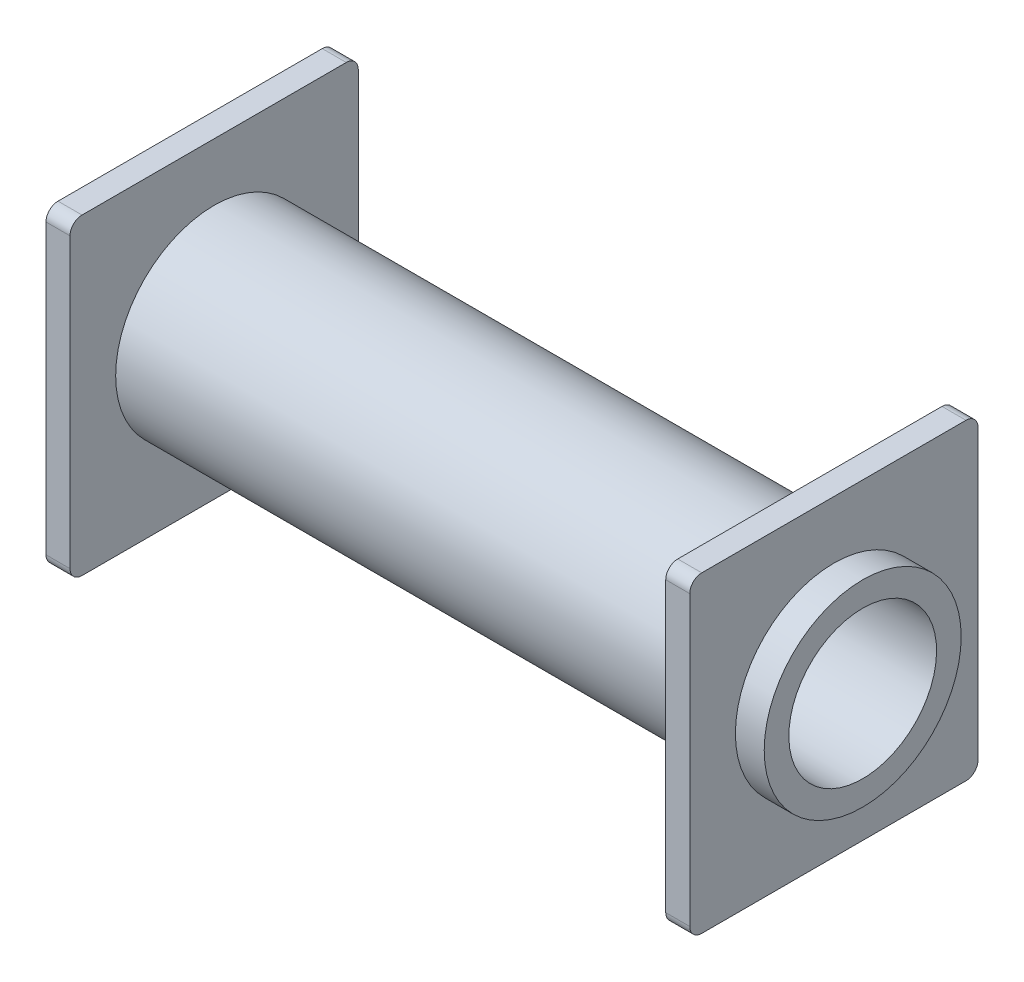
ISO-10303-21;
HEADER;
FILE_DESCRIPTION(('STEP AP214'),'2;1');
FILE_NAME('part.step','',(''),(''),'','','');
FILE_SCHEMA(('AUTOMOTIVE_DESIGN { 1 0 10303 214 1 1 1 1 }'));
ENDSEC;
DATA;
#1=APPLICATION_CONTEXT('core data for automotive mechanical design processes');
#2=APPLICATION_PROTOCOL_DEFINITION('international standard','automotive_design',2000,#1);
#3=PRODUCT_CONTEXT('',#1,'mechanical');
#4=PRODUCT('Part','Part','',(#3));
#5=PRODUCT_RELATED_PRODUCT_CATEGORY('part','',(#4));
#6=PRODUCT_DEFINITION_FORMATION('','',#4);
#7=PRODUCT_DEFINITION_CONTEXT('part definition',#1,'design');
#8=PRODUCT_DEFINITION('design','',#6,#7);
#9=PRODUCT_DEFINITION_SHAPE('','',#8);
#10=(LENGTH_UNIT() NAMED_UNIT(*) SI_UNIT(.MILLI.,.METRE.));
#11=(NAMED_UNIT(*) PLANE_ANGLE_UNIT() SI_UNIT($,.RADIAN.));
#12=(NAMED_UNIT(*) SI_UNIT($,.STERADIAN.) SOLID_ANGLE_UNIT());
#13=UNCERTAINTY_MEASURE_WITH_UNIT(LENGTH_MEASURE(1.E-05),#10,'distance_accuracy_value','');
#14=(GEOMETRIC_REPRESENTATION_CONTEXT(3) GLOBAL_UNCERTAINTY_ASSIGNED_CONTEXT((#13)) GLOBAL_UNIT_ASSIGNED_CONTEXT((#10,
#11,#12)) REPRESENTATION_CONTEXT('',''));
#15=CARTESIAN_POINT('',(0.,0.,0.));
#16=DIRECTION('',(0.,0.,1.));
#17=DIRECTION('',(1.,0.,0.));
#18=AXIS2_PLACEMENT_3D('',#15,#16,#17);
#19=CARTESIAN_POINT('',(-14.,0.,0.));
#20=DIRECTION('',(-1.,0.,0.));
#21=DIRECTION('',(0.,-1.,0.));
#22=AXIS2_PLACEMENT_3D('',#19,#20,#21);
#23=CYLINDRICAL_SURFACE('',#22,4.1);
#24=CARTESIAN_POINT('',(12.8,0.,0.));
#25=DIRECTION('',(1.,0.,0.));
#26=DIRECTION('',(0.,1.,0.));
#27=AXIS2_PLACEMENT_3D('',#24,#25,#26);
#28=CIRCLE('',#27,4.1);
#29=CARTESIAN_POINT('',(12.8,4.1,0.));
#30=VERTEX_POINT('',#29);
#31=EDGE_CURVE('E321',#30,#30,#28,.T.);
#32=ORIENTED_EDGE('',*,*,#31,.T.);
#33=EDGE_LOOP('',(#32));
#34=FACE_BOUND('',#33,.T.);
#35=CARTESIAN_POINT('',(14.,0.,0.));
#36=DIRECTION('',(-1.,0.,0.));
#37=DIRECTION('',(0.,-1.,0.));
#38=AXIS2_PLACEMENT_3D('',#35,#36,#37);
#39=CIRCLE('',#38,4.1);
#40=CARTESIAN_POINT('',(14.,-4.09999999999999,0.));
#41=VERTEX_POINT('',#40);
#42=EDGE_CURVE('E193',#41,#41,#39,.T.);
#43=ORIENTED_EDGE('',*,*,#42,.T.);
#44=EDGE_LOOP('',(#43));
#45=FACE_BOUND('',#44,.T.);
#46=ADVANCED_FACE('F41',(#34,#45),#23,.T.);
#47=CARTESIAN_POINT('',(14.,0.,0.));
#48=DIRECTION('',(-1.,0.,0.));
#49=DIRECTION('',(0.,-1.,0.));
#50=AXIS2_PLACEMENT_3D('',#47,#48,#49);
#51=PLANE('',#50);
#52=CARTESIAN_POINT('',(14.,0.,0.));
#53=DIRECTION('',(1.,0.,0.));
#54=DIRECTION('',(0.,1.,0.));
#55=AXIS2_PLACEMENT_3D('',#52,#53,#54);
#56=CIRCLE('',#55,3.075);
#57=CARTESIAN_POINT('',(14.,3.07500000000001,0.));
#58=VERTEX_POINT('',#57);
#59=EDGE_CURVE('E445',#58,#58,#56,.T.);
#60=ORIENTED_EDGE('',*,*,#59,.F.);
#61=EDGE_LOOP('',(#60));
#62=FACE_BOUND('',#61,.T.);
#63=ORIENTED_EDGE('',*,*,#42,.F.);
#64=EDGE_LOOP('',(#63));
#65=FACE_BOUND('',#64,.T.);
#66=ADVANCED_FACE('F386',(#62,#65),#51,.F.);
#67=CARTESIAN_POINT('',(12.8,6.5,6.));
#68=DIRECTION('',(0.,0.,-1.));
#69=DIRECTION('',(0.,1.,0.));
#70=AXIS2_PLACEMENT_3D('',#67,#68,#69);
#71=PLANE('',#70);
#72=DIRECTION('',(0.,-1.,0.));
#73=VECTOR('',#72,1.);
#74=CARTESIAN_POINT('',(11.8,6.5,6.));
#75=LINE('',#74,#73);
#76=CARTESIAN_POINT('',(11.8,6.,6.));
#77=VERTEX_POINT('',#76);
#78=CARTESIAN_POINT('',(11.8,-5.99999999999999,6.));
#79=VERTEX_POINT('',#78);
#80=EDGE_CURVE('E290',#77,#79,#75,.T.);
#81=ORIENTED_EDGE('',*,*,#80,.T.);
#82=DIRECTION('',(-1.,0.,0.));
#83=VECTOR('',#82,1.);
#84=CARTESIAN_POINT('',(12.8,-6.,6.));
#85=LINE('',#84,#83);
#86=CARTESIAN_POINT('',(12.8,-5.99999999999999,6.));
#87=VERTEX_POINT('',#86);
#88=EDGE_CURVE('E278',#79,#87,#85,.F.);
#89=ORIENTED_EDGE('',*,*,#88,.T.);
#90=DIRECTION('',(0.,-1.,0.));
#91=VECTOR('',#90,1.);
#92=CARTESIAN_POINT('',(12.8,6.5,6.));
#93=LINE('',#92,#91);
#94=CARTESIAN_POINT('',(12.8,6.,6.));
#95=VERTEX_POINT('',#94);
#96=EDGE_CURVE('E306',#95,#87,#93,.T.);
#97=ORIENTED_EDGE('',*,*,#96,.F.);
#98=DIRECTION('',(-1.,0.,0.));
#99=VECTOR('',#98,1.);
#100=CARTESIAN_POINT('',(12.8,6.,6.));
#101=LINE('',#100,#99);
#102=EDGE_CURVE('E274',#95,#77,#101,.T.);
#103=ORIENTED_EDGE('',*,*,#102,.T.);
#104=EDGE_LOOP('',(#81,#89,#97,#103));
#105=FACE_BOUND('',#104,.T.);
#106=ADVANCED_FACE('F374',(#105),#71,.F.);
#107=CARTESIAN_POINT('',(12.8,-6.5,6.));
#108=DIRECTION('',(0.,1.,0.));
#109=DIRECTION('',(-1.,0.,0.));
#110=AXIS2_PLACEMENT_3D('',#107,#108,#109);
#111=PLANE('',#110);
#112=DIRECTION('',(0.,0.,-1.));
#113=VECTOR('',#112,1.);
#114=CARTESIAN_POINT('',(11.8,-6.5,6.));
#115=LINE('',#114,#113);
#116=CARTESIAN_POINT('',(11.8,-6.5,5.5));
#117=VERTEX_POINT('',#116);
#118=CARTESIAN_POINT('',(11.8,-6.5,-5.5));
#119=VERTEX_POINT('',#118);
#120=EDGE_CURVE('E325',#117,#119,#115,.T.);
#121=ORIENTED_EDGE('',*,*,#120,.T.);
#122=DIRECTION('',(-1.,0.,0.));
#123=VECTOR('',#122,1.);
#124=CARTESIAN_POINT('',(12.8,-6.5,-5.5));
#125=LINE('',#124,#123);
#126=CARTESIAN_POINT('',(12.8,-6.5,-5.5));
#127=VERTEX_POINT('',#126);
#128=EDGE_CURVE('E260',#119,#127,#125,.F.);
#129=ORIENTED_EDGE('',*,*,#128,.T.);
#130=DIRECTION('',(0.,0.,-1.));
#131=VECTOR('',#130,1.);
#132=CARTESIAN_POINT('',(12.8,-6.5,6.));
#133=LINE('',#132,#131);
#134=CARTESIAN_POINT('',(12.8,-6.5,5.5));
#135=VERTEX_POINT('',#134);
#136=EDGE_CURVE('E310',#135,#127,#133,.T.);
#137=ORIENTED_EDGE('',*,*,#136,.F.);
#138=DIRECTION('',(-1.,0.,0.));
#139=VECTOR('',#138,1.);
#140=CARTESIAN_POINT('',(12.8,-6.5,5.5));
#141=LINE('',#140,#139);
#142=EDGE_CURVE('E256',#135,#117,#141,.T.);
#143=ORIENTED_EDGE('',*,*,#142,.T.);
#144=EDGE_LOOP('',(#121,#129,#137,#143));
#145=FACE_BOUND('',#144,.T.);
#146=ADVANCED_FACE('F378',(#145),#111,.F.);
#147=CARTESIAN_POINT('',(12.8,6.5,-6.));
#148=DIRECTION('',(0.,0.,1.));
#149=DIRECTION('',(0.,-1.,0.));
#150=AXIS2_PLACEMENT_3D('',#147,#148,#149);
#151=PLANE('',#150);
#152=DIRECTION('',(0.,1.,0.));
#153=VECTOR('',#152,1.);
#154=CARTESIAN_POINT('',(12.8,6.5,-6.));
#155=LINE('',#154,#153);
#156=CARTESIAN_POINT('',(12.8,-5.99999999999999,-6.));
#157=VERTEX_POINT('',#156);
#158=CARTESIAN_POINT('',(12.8,6.,-6.));
#159=VERTEX_POINT('',#158);
#160=EDGE_CURVE('E315',#157,#159,#155,.T.);
#161=ORIENTED_EDGE('',*,*,#160,.F.);
#162=DIRECTION('',(-1.,0.,0.));
#163=VECTOR('',#162,1.);
#164=CARTESIAN_POINT('',(12.8,-6.,-6.));
#165=LINE('',#164,#163);
#166=CARTESIAN_POINT('',(11.8,-5.99999999999999,-6.));
#167=VERTEX_POINT('',#166);
#168=EDGE_CURVE('E240',#157,#167,#165,.T.);
#169=ORIENTED_EDGE('',*,*,#168,.T.);
#170=DIRECTION('',(0.,1.,0.));
#171=VECTOR('',#170,1.);
#172=CARTESIAN_POINT('',(11.8,6.5,-6.));
#173=LINE('',#172,#171);
#174=CARTESIAN_POINT('',(11.8,6.,-6.));
#175=VERTEX_POINT('',#174);
#176=EDGE_CURVE('E329',#167,#175,#173,.T.);
#177=ORIENTED_EDGE('',*,*,#176,.T.);
#178=DIRECTION('',(-1.,0.,0.));
#179=VECTOR('',#178,1.);
#180=CARTESIAN_POINT('',(12.8,6.,-6.));
#181=LINE('',#180,#179);
#182=EDGE_CURVE('E237',#175,#159,#181,.F.);
#183=ORIENTED_EDGE('',*,*,#182,.T.);
#184=EDGE_LOOP('',(#161,#169,#177,#183));
#185=FACE_BOUND('',#184,.T.);
#186=ADVANCED_FACE('F360',(#185),#151,.F.);
#187=CARTESIAN_POINT('',(12.8,6.5,6.));
#188=DIRECTION('',(0.,-1.,0.));
#189=DIRECTION('',(1.,0.,0.));
#190=AXIS2_PLACEMENT_3D('',#187,#188,#189);
#191=PLANE('',#190);
#192=DIRECTION('',(0.,0.,1.));
#193=VECTOR('',#192,1.);
#194=CARTESIAN_POINT('',(12.8,6.5,6.));
#195=LINE('',#194,#193);
#196=CARTESIAN_POINT('',(12.8,6.5,-5.5));
#197=VERTEX_POINT('',#196);
#198=CARTESIAN_POINT('',(12.8,6.5,5.5));
#199=VERTEX_POINT('',#198);
#200=EDGE_CURVE('E318',#197,#199,#195,.T.);
#201=ORIENTED_EDGE('',*,*,#200,.F.);
#202=DIRECTION('',(-1.,0.,0.));
#203=VECTOR('',#202,1.);
#204=CARTESIAN_POINT('',(12.8,6.5,-5.5));
#205=LINE('',#204,#203);
#206=CARTESIAN_POINT('',(11.8,6.5,-5.5));
#207=VERTEX_POINT('',#206);
#208=EDGE_CURVE('E11',#197,#207,#205,.T.);
#209=ORIENTED_EDGE('',*,*,#208,.T.);
#210=DIRECTION('',(0.,0.,1.));
#211=VECTOR('',#210,1.);
#212=CARTESIAN_POINT('',(11.8,6.5,6.));
#213=LINE('',#212,#211);
#214=CARTESIAN_POINT('',(11.8,6.5,5.5));
#215=VERTEX_POINT('',#214);
#216=EDGE_CURVE('E311',#207,#215,#213,.T.);
#217=ORIENTED_EDGE('',*,*,#216,.T.);
#218=DIRECTION('',(-1.,0.,0.));
#219=VECTOR('',#218,1.);
#220=CARTESIAN_POINT('',(12.8,6.5,5.5));
#221=LINE('',#220,#219);
#222=EDGE_CURVE('E50',#215,#199,#221,.F.);
#223=ORIENTED_EDGE('',*,*,#222,.T.);
#224=EDGE_LOOP('',(#201,#209,#217,#223));
#225=FACE_BOUND('',#224,.T.);
#226=ADVANCED_FACE('F346',(#225),#191,.F.);
#227=CARTESIAN_POINT('',(12.8,0.,0.));
#228=DIRECTION('',(1.,0.,0.));
#229=DIRECTION('',(0.,1.,0.));
#230=AXIS2_PLACEMENT_3D('',#227,#228,#229);
#231=PLANE('',#230);
#232=ORIENTED_EDGE('',*,*,#31,.F.);
#233=EDGE_LOOP('',(#232));
#234=FACE_BOUND('',#233,.T.);
#235=ORIENTED_EDGE('',*,*,#136,.T.);
#236=CARTESIAN_POINT('',(12.8,-6.,-5.5));
#237=DIRECTION('',(1.,0.,0.));
#238=DIRECTION('',(0.,1.,0.));
#239=AXIS2_PLACEMENT_3D('',#236,#237,#238);
#240=CIRCLE('',#239,0.5);
#241=EDGE_CURVE('E271',#127,#157,#240,.T.);
#242=ORIENTED_EDGE('',*,*,#241,.T.);
#243=ORIENTED_EDGE('',*,*,#160,.T.);
#244=CARTESIAN_POINT('',(12.8,6.,-5.5));
#245=DIRECTION('',(1.,0.,0.));
#246=DIRECTION('',(0.,1.,0.));
#247=AXIS2_PLACEMENT_3D('',#244,#245,#246);
#248=CIRCLE('',#247,0.5);
#249=EDGE_CURVE('E63',#159,#197,#248,.T.);
#250=ORIENTED_EDGE('',*,*,#249,.T.);
#251=ORIENTED_EDGE('',*,*,#200,.T.);
#252=CARTESIAN_POINT('',(12.8,6.,5.5));
#253=DIRECTION('',(1.,0.,0.));
#254=DIRECTION('',(0.,1.,0.));
#255=AXIS2_PLACEMENT_3D('',#252,#253,#254);
#256=CIRCLE('',#255,0.5);
#257=EDGE_CURVE('E263',#199,#95,#256,.T.);
#258=ORIENTED_EDGE('',*,*,#257,.T.);
#259=ORIENTED_EDGE('',*,*,#96,.T.);
#260=CARTESIAN_POINT('',(12.8,-6.,5.5));
#261=DIRECTION('',(1.,0.,0.));
#262=DIRECTION('',(0.,1.,0.));
#263=AXIS2_PLACEMENT_3D('',#260,#261,#262);
#264=CIRCLE('',#263,0.5);
#265=EDGE_CURVE('E268',#87,#135,#264,.T.);
#266=ORIENTED_EDGE('',*,*,#265,.T.);
#267=EDGE_LOOP('',(#235,#242,#243,#250,#251,#258,#259,#266));
#268=FACE_BOUND('',#267,.T.);
#269=ADVANCED_FACE('F343',(#234,#268),#231,.T.);
#270=CARTESIAN_POINT('',(11.8,0.,0.));
#271=DIRECTION('',(1.,0.,0.));
#272=DIRECTION('',(0.,1.,0.));
#273=AXIS2_PLACEMENT_3D('',#270,#271,#272);
#274=PLANE('',#273);
#275=CARTESIAN_POINT('',(11.8,0.,0.));
#276=DIRECTION('',(1.,0.,0.));
#277=DIRECTION('',(0.,1.,0.));
#278=AXIS2_PLACEMENT_3D('',#275,#276,#277);
#279=CIRCLE('',#278,4.1);
#280=CARTESIAN_POINT('',(11.8,4.1,0.));
#281=VERTEX_POINT('',#280);
#282=EDGE_CURVE('E186',#281,#281,#279,.T.);
#283=ORIENTED_EDGE('',*,*,#282,.T.);
#284=EDGE_LOOP('',(#283));
#285=FACE_BOUND('',#284,.T.);
#286=ORIENTED_EDGE('',*,*,#176,.F.);
#287=CARTESIAN_POINT('',(11.8,-6.,-5.5));
#288=DIRECTION('',(1.,0.,0.));
#289=DIRECTION('',(0.,1.,0.));
#290=AXIS2_PLACEMENT_3D('',#287,#288,#289);
#291=CIRCLE('',#290,0.5);
#292=EDGE_CURVE('E253',#167,#119,#291,.F.);
#293=ORIENTED_EDGE('',*,*,#292,.T.);
#294=ORIENTED_EDGE('',*,*,#120,.F.);
#295=CARTESIAN_POINT('',(11.8,-6.,5.5));
#296=DIRECTION('',(1.,0.,0.));
#297=DIRECTION('',(0.,1.,0.));
#298=AXIS2_PLACEMENT_3D('',#295,#296,#297);
#299=CIRCLE('',#298,0.5);
#300=EDGE_CURVE('E250',#117,#79,#299,.F.);
#301=ORIENTED_EDGE('',*,*,#300,.T.);
#302=ORIENTED_EDGE('',*,*,#80,.F.);
#303=CARTESIAN_POINT('',(11.8,6.,5.5));
#304=DIRECTION('',(1.,0.,0.));
#305=DIRECTION('',(0.,1.,0.));
#306=AXIS2_PLACEMENT_3D('',#303,#304,#305);
#307=CIRCLE('',#306,0.5);
#308=EDGE_CURVE('E244',#77,#215,#307,.F.);
#309=ORIENTED_EDGE('',*,*,#308,.T.);
#310=ORIENTED_EDGE('',*,*,#216,.F.);
#311=CARTESIAN_POINT('',(11.8,6.,-5.5));
#312=DIRECTION('',(1.,0.,0.));
#313=DIRECTION('',(0.,1.,0.));
#314=AXIS2_PLACEMENT_3D('',#311,#312,#313);
#315=CIRCLE('',#314,0.5);
#316=EDGE_CURVE('E247',#207,#175,#315,.F.);
#317=ORIENTED_EDGE('',*,*,#316,.T.);
#318=EDGE_LOOP('',(#286,#293,#294,#301,#302,#309,#310,#317));
#319=FACE_BOUND('',#318,.T.);
#320=ADVANCED_FACE('F345',(#285,#319),#274,.F.);
#321=CARTESIAN_POINT('',(-13.,0.,0.));
#322=DIRECTION('',(1.,0.,0.));
#323=DIRECTION('',(0.,1.,0.));
#324=AXIS2_PLACEMENT_3D('',#321,#322,#323);
#325=CIRCLE('',#324,4.1);
#326=CARTESIAN_POINT('',(-13.,4.1,0.));
#327=VERTEX_POINT('',#326);
#328=EDGE_CURVE('E196',#327,#327,#325,.T.);
#329=ORIENTED_EDGE('',*,*,#328,.T.);
#330=EDGE_LOOP('',(#329));
#331=FACE_BOUND('',#330,.T.);
#332=ORIENTED_EDGE('',*,*,#282,.F.);
#333=EDGE_LOOP('',(#332));
#334=FACE_BOUND('',#333,.T.);
#335=ADVANCED_FACE('F390',(#331,#334),#23,.T.);
#336=CARTESIAN_POINT('',(-13.,-6.5,-6.));
#337=DIRECTION('',(0.,0.,-1.));
#338=DIRECTION('',(0.,1.,0.));
#339=AXIS2_PLACEMENT_3D('',#336,#337,#338);
#340=PLANE('',#339);
#341=DIRECTION('',(0.,-1.,0.));
#342=VECTOR('',#341,1.);
#343=CARTESIAN_POINT('',(-13.,-6.5,-6.));
#344=LINE('',#343,#342);
#345=CARTESIAN_POINT('',(-13.,5.99999999999999,-6.));
#346=VERTEX_POINT('',#345);
#347=CARTESIAN_POINT('',(-13.,-6.,-6.));
#348=VERTEX_POINT('',#347);
#349=EDGE_CURVE('E305',#346,#348,#344,.T.);
#350=ORIENTED_EDGE('',*,*,#349,.T.);
#351=DIRECTION('',(-1.,0.,0.));
#352=VECTOR('',#351,1.);
#353=CARTESIAN_POINT('',(-13.,-6.,-6.));
#354=LINE('',#353,#352);
#355=CARTESIAN_POINT('',(-14.,-6.,-6.));
#356=VERTEX_POINT('',#355);
#357=EDGE_CURVE('E177',#348,#356,#354,.T.);
#358=ORIENTED_EDGE('',*,*,#357,.T.);
#359=DIRECTION('',(0.,-1.,0.));
#360=VECTOR('',#359,1.);
#361=CARTESIAN_POINT('',(-14.,-6.5,-6.));
#362=LINE('',#361,#360);
#363=CARTESIAN_POINT('',(-14.,5.99999999999999,-6.));
#364=VERTEX_POINT('',#363);
#365=EDGE_CURVE('E159',#364,#356,#362,.T.);
#366=ORIENTED_EDGE('',*,*,#365,.F.);
#367=DIRECTION('',(-1.,0.,0.));
#368=VECTOR('',#367,1.);
#369=CARTESIAN_POINT('',(-13.,6.,-6.));
#370=LINE('',#369,#368);
#371=EDGE_CURVE('E174',#364,#346,#370,.F.);
#372=ORIENTED_EDGE('',*,*,#371,.T.);
#373=EDGE_LOOP('',(#350,#358,#366,#372));
#374=FACE_BOUND('',#373,.T.);
#375=ADVANCED_FACE('F173',(#374),#340,.T.);
#376=CARTESIAN_POINT('',(-13.,6.5,-6.));
#377=DIRECTION('',(0.,1.,0.));
#378=DIRECTION('',(-1.,0.,0.));
#379=AXIS2_PLACEMENT_3D('',#376,#377,#378);
#380=PLANE('',#379);
#381=DIRECTION('',(0.,0.,-1.));
#382=VECTOR('',#381,1.);
#383=CARTESIAN_POINT('',(-13.,6.5,-6.));
#384=LINE('',#383,#382);
#385=CARTESIAN_POINT('',(-13.,6.5,5.5));
#386=VERTEX_POINT('',#385);
#387=CARTESIAN_POINT('',(-13.,6.5,-5.5));
#388=VERTEX_POINT('',#387);
#389=EDGE_CURVE('E282',#386,#388,#384,.T.);
#390=ORIENTED_EDGE('',*,*,#389,.T.);
#391=DIRECTION('',(-1.,0.,0.));
#392=VECTOR('',#391,1.);
#393=CARTESIAN_POINT('',(-13.,6.5,-5.5));
#394=LINE('',#393,#392);
#395=CARTESIAN_POINT('',(-14.,6.5,-5.5));
#396=VERTEX_POINT('',#395);
#397=EDGE_CURVE('E234',#388,#396,#394,.T.);
#398=ORIENTED_EDGE('',*,*,#397,.T.);
#399=DIRECTION('',(0.,0.,-1.));
#400=VECTOR('',#399,1.);
#401=CARTESIAN_POINT('',(-14.,6.5,-6.));
#402=LINE('',#401,#400);
#403=CARTESIAN_POINT('',(-14.,6.5,5.5));
#404=VERTEX_POINT('',#403);
#405=EDGE_CURVE('E161',#404,#396,#402,.T.);
#406=ORIENTED_EDGE('',*,*,#405,.F.);
#407=DIRECTION('',(-1.,0.,0.));
#408=VECTOR('',#407,1.);
#409=CARTESIAN_POINT('',(-13.,6.5,5.5));
#410=LINE('',#409,#408);
#411=EDGE_CURVE('E231',#404,#386,#410,.F.);
#412=ORIENTED_EDGE('',*,*,#411,.T.);
#413=EDGE_LOOP('',(#390,#398,#406,#412));
#414=FACE_BOUND('',#413,.T.);
#415=ADVANCED_FACE('F403',(#414),#380,.T.);
#416=CARTESIAN_POINT('',(-13.,6.5,6.));
#417=DIRECTION('',(0.,0.,1.));
#418=DIRECTION('',(0.,-1.,0.));
#419=AXIS2_PLACEMENT_3D('',#416,#417,#418);
#420=PLANE('',#419);
#421=DIRECTION('',(0.,1.,0.));
#422=VECTOR('',#421,1.);
#423=CARTESIAN_POINT('',(-14.,6.5,6.));
#424=LINE('',#423,#422);
#425=CARTESIAN_POINT('',(-14.,-6.,6.));
#426=VERTEX_POINT('',#425);
#427=CARTESIAN_POINT('',(-14.,6.,6.));
#428=VERTEX_POINT('',#427);
#429=EDGE_CURVE('E299',#426,#428,#424,.T.);
#430=ORIENTED_EDGE('',*,*,#429,.F.);
#431=DIRECTION('',(-1.,0.,0.));
#432=VECTOR('',#431,1.);
#433=CARTESIAN_POINT('',(-13.,-6.,6.));
#434=LINE('',#433,#432);
#435=CARTESIAN_POINT('',(-13.,-6.,6.));
#436=VERTEX_POINT('',#435);
#437=EDGE_CURVE('E228',#426,#436,#434,.F.);
#438=ORIENTED_EDGE('',*,*,#437,.T.);
#439=DIRECTION('',(0.,1.,0.));
#440=VECTOR('',#439,1.);
#441=CARTESIAN_POINT('',(-13.,6.5,6.));
#442=LINE('',#441,#440);
#443=CARTESIAN_POINT('',(-13.,6.,6.));
#444=VERTEX_POINT('',#443);
#445=EDGE_CURVE('E284',#436,#444,#442,.T.);
#446=ORIENTED_EDGE('',*,*,#445,.T.);
#447=DIRECTION('',(-1.,0.,0.));
#448=VECTOR('',#447,1.);
#449=CARTESIAN_POINT('',(-13.,6.,6.));
#450=LINE('',#449,#448);
#451=EDGE_CURVE('E224',#444,#428,#450,.T.);
#452=ORIENTED_EDGE('',*,*,#451,.T.);
#453=EDGE_LOOP('',(#430,#438,#446,#452));
#454=FACE_BOUND('',#453,.T.);
#455=ADVANCED_FACE('F433',(#454),#420,.T.);
#456=CARTESIAN_POINT('',(-13.,-6.5,6.));
#457=DIRECTION('',(0.,-1.,0.));
#458=DIRECTION('',(1.,0.,0.));
#459=AXIS2_PLACEMENT_3D('',#456,#457,#458);
#460=PLANE('',#459);
#461=DIRECTION('',(0.,0.,1.));
#462=VECTOR('',#461,1.);
#463=CARTESIAN_POINT('',(-14.,-6.5,6.));
#464=LINE('',#463,#462);
#465=CARTESIAN_POINT('',(-14.,-6.5,-5.5));
#466=VERTEX_POINT('',#465);
#467=CARTESIAN_POINT('',(-14.,-6.5,5.5));
#468=VERTEX_POINT('',#467);
#469=EDGE_CURVE('E179',#466,#468,#464,.T.);
#470=ORIENTED_EDGE('',*,*,#469,.F.);
#471=DIRECTION('',(-1.,0.,0.));
#472=VECTOR('',#471,1.);
#473=CARTESIAN_POINT('',(-13.,-6.5,-5.5));
#474=LINE('',#473,#472);
#475=CARTESIAN_POINT('',(-13.,-6.5,-5.5));
#476=VERTEX_POINT('',#475);
#477=EDGE_CURVE('E210',#466,#476,#474,.F.);
#478=ORIENTED_EDGE('',*,*,#477,.T.);
#479=DIRECTION('',(0.,0.,1.));
#480=VECTOR('',#479,1.);
#481=CARTESIAN_POINT('',(-13.,-6.5,6.));
#482=LINE('',#481,#480);
#483=CARTESIAN_POINT('',(-13.,-6.5,5.5));
#484=VERTEX_POINT('',#483);
#485=EDGE_CURVE('E292',#476,#484,#482,.T.);
#486=ORIENTED_EDGE('',*,*,#485,.T.);
#487=DIRECTION('',(-1.,0.,0.));
#488=VECTOR('',#487,1.);
#489=CARTESIAN_POINT('',(-13.,-6.5,5.5));
#490=LINE('',#489,#488);
#491=EDGE_CURVE('E206',#484,#468,#490,.T.);
#492=ORIENTED_EDGE('',*,*,#491,.T.);
#493=EDGE_LOOP('',(#470,#478,#486,#492));
#494=FACE_BOUND('',#493,.T.);
#495=ADVANCED_FACE('F414',(#494),#460,.T.);
#496=CARTESIAN_POINT('',(-13.,0.,0.));
#497=DIRECTION('',(1.,0.,0.));
#498=DIRECTION('',(0.,1.,0.));
#499=AXIS2_PLACEMENT_3D('',#496,#497,#498);
#500=PLANE('',#499);
#501=ORIENTED_EDGE('',*,*,#328,.F.);
#502=EDGE_LOOP('',(#501));
#503=FACE_BOUND('',#502,.T.);
#504=ORIENTED_EDGE('',*,*,#485,.F.);
#505=CARTESIAN_POINT('',(-13.,-6.,-5.5));
#506=DIRECTION('',(1.,0.,0.));
#507=DIRECTION('',(0.,1.,0.));
#508=AXIS2_PLACEMENT_3D('',#505,#506,#507);
#509=CIRCLE('',#508,0.5);
#510=EDGE_CURVE('E221',#476,#348,#509,.T.);
#511=ORIENTED_EDGE('',*,*,#510,.T.);
#512=ORIENTED_EDGE('',*,*,#349,.F.);
#513=CARTESIAN_POINT('',(-13.,6.,-5.5));
#514=DIRECTION('',(1.,0.,0.));
#515=DIRECTION('',(0.,1.,0.));
#516=AXIS2_PLACEMENT_3D('',#513,#514,#515);
#517=CIRCLE('',#516,0.5);
#518=EDGE_CURVE('E184',#346,#388,#517,.T.);
#519=ORIENTED_EDGE('',*,*,#518,.T.);
#520=ORIENTED_EDGE('',*,*,#389,.F.);
#521=CARTESIAN_POINT('',(-13.,6.,5.5));
#522=DIRECTION('',(1.,0.,0.));
#523=DIRECTION('',(0.,1.,0.));
#524=AXIS2_PLACEMENT_3D('',#521,#522,#523);
#525=CIRCLE('',#524,0.5);
#526=EDGE_CURVE('E213',#386,#444,#525,.T.);
#527=ORIENTED_EDGE('',*,*,#526,.T.);
#528=ORIENTED_EDGE('',*,*,#445,.F.);
#529=CARTESIAN_POINT('',(-13.,-6.,5.5));
#530=DIRECTION('',(1.,0.,0.));
#531=DIRECTION('',(0.,1.,0.));
#532=AXIS2_PLACEMENT_3D('',#529,#530,#531);
#533=CIRCLE('',#532,0.5);
#534=EDGE_CURVE('E218',#436,#484,#533,.T.);
#535=ORIENTED_EDGE('',*,*,#534,.T.);
#536=EDGE_LOOP('',(#504,#511,#512,#519,#520,#527,#528,#535));
#537=FACE_BOUND('',#536,.T.);
#538=ADVANCED_FACE('F411',(#503,#537),#500,.T.);
#539=CARTESIAN_POINT('',(-14.,0.,0.));
#540=DIRECTION('',(1.,0.,0.));
#541=DIRECTION('',(0.,1.,0.));
#542=AXIS2_PLACEMENT_3D('',#539,#540,#541);
#543=PLANE('',#542);
#544=CARTESIAN_POINT('',(-14.,0.,0.));
#545=DIRECTION('',(1.,0.,0.));
#546=DIRECTION('',(0.,1.,0.));
#547=AXIS2_PLACEMENT_3D('',#544,#545,#546);
#548=CIRCLE('',#547,3.075);
#549=CARTESIAN_POINT('',(-14.,3.075,0.));
#550=VERTEX_POINT('',#549);
#551=EDGE_CURVE('E180',#550,#550,#548,.F.);
#552=ORIENTED_EDGE('',*,*,#551,.F.);
#553=EDGE_LOOP('',(#552));
#554=FACE_BOUND('',#553,.T.);
#555=ORIENTED_EDGE('',*,*,#365,.T.);
#556=CARTESIAN_POINT('',(-14.,-6.,-5.5));
#557=DIRECTION('',(1.,0.,0.));
#558=DIRECTION('',(0.,1.,0.));
#559=AXIS2_PLACEMENT_3D('',#556,#557,#558);
#560=CIRCLE('',#559,0.5);
#561=EDGE_CURVE('E203',#356,#466,#560,.F.);
#562=ORIENTED_EDGE('',*,*,#561,.T.);
#563=ORIENTED_EDGE('',*,*,#469,.T.);
#564=CARTESIAN_POINT('',(-14.,-6.,5.5));
#565=DIRECTION('',(1.,0.,0.));
#566=DIRECTION('',(0.,1.,0.));
#567=AXIS2_PLACEMENT_3D('',#564,#565,#566);
#568=CIRCLE('',#567,0.5);
#569=EDGE_CURVE('E167',#468,#426,#568,.F.);
#570=ORIENTED_EDGE('',*,*,#569,.T.);
#571=ORIENTED_EDGE('',*,*,#429,.T.);
#572=CARTESIAN_POINT('',(-14.,6.,5.5));
#573=DIRECTION('',(1.,0.,0.));
#574=DIRECTION('',(0.,1.,0.));
#575=AXIS2_PLACEMENT_3D('',#572,#573,#574);
#576=CIRCLE('',#575,0.5);
#577=EDGE_CURVE('E168',#428,#404,#576,.F.);
#578=ORIENTED_EDGE('',*,*,#577,.T.);
#579=ORIENTED_EDGE('',*,*,#405,.T.);
#580=CARTESIAN_POINT('',(-14.,6.,-5.5));
#581=DIRECTION('',(1.,0.,0.));
#582=DIRECTION('',(0.,1.,0.));
#583=AXIS2_PLACEMENT_3D('',#580,#581,#582);
#584=CIRCLE('',#583,0.5);
#585=EDGE_CURVE('E156',#396,#364,#584,.F.);
#586=ORIENTED_EDGE('',*,*,#585,.T.);
#587=EDGE_LOOP('',(#555,#562,#563,#570,#571,#578,#579,#586));
#588=FACE_BOUND('',#587,.T.);
#589=ADVANCED_FACE('F158',(#554,#588),#543,.F.);
#590=CARTESIAN_POINT('',(-13.,-6.,-5.5));
#591=DIRECTION('',(-1.,0.,0.));
#592=DIRECTION('',(0.,-1.,0.));
#593=AXIS2_PLACEMENT_3D('',#590,#591,#592);
#594=CYLINDRICAL_SURFACE('',#593,0.5);
#595=ORIENTED_EDGE('',*,*,#510,.F.);
#596=ORIENTED_EDGE('',*,*,#477,.F.);
#597=ORIENTED_EDGE('',*,*,#561,.F.);
#598=ORIENTED_EDGE('',*,*,#357,.F.);
#599=EDGE_LOOP('',(#595,#596,#597,#598));
#600=FACE_BOUND('',#599,.T.);
#601=ADVANCED_FACE('F426',(#600),#594,.T.);
#602=CARTESIAN_POINT('',(-13.,-6.,5.5));
#603=DIRECTION('',(-1.,0.,0.));
#604=DIRECTION('',(0.,-1.,0.));
#605=AXIS2_PLACEMENT_3D('',#602,#603,#604);
#606=CYLINDRICAL_SURFACE('',#605,0.5);
#607=ORIENTED_EDGE('',*,*,#534,.F.);
#608=ORIENTED_EDGE('',*,*,#437,.F.);
#609=ORIENTED_EDGE('',*,*,#569,.F.);
#610=ORIENTED_EDGE('',*,*,#491,.F.);
#611=EDGE_LOOP('',(#607,#608,#609,#610));
#612=FACE_BOUND('',#611,.T.);
#613=ADVANCED_FACE('F429',(#612),#606,.T.);
#614=CARTESIAN_POINT('',(-13.,6.,-5.5));
#615=DIRECTION('',(-1.,0.,0.));
#616=DIRECTION('',(0.,-1.,0.));
#617=AXIS2_PLACEMENT_3D('',#614,#615,#616);
#618=CYLINDRICAL_SURFACE('',#617,0.5);
#619=ORIENTED_EDGE('',*,*,#518,.F.);
#620=ORIENTED_EDGE('',*,*,#371,.F.);
#621=ORIENTED_EDGE('',*,*,#585,.F.);
#622=ORIENTED_EDGE('',*,*,#397,.F.);
#623=EDGE_LOOP('',(#619,#620,#621,#622));
#624=FACE_BOUND('',#623,.T.);
#625=ADVANCED_FACE('F183',(#624),#618,.T.);
#626=CARTESIAN_POINT('',(-13.,6.,5.5));
#627=DIRECTION('',(-1.,0.,0.));
#628=DIRECTION('',(0.,-1.,0.));
#629=AXIS2_PLACEMENT_3D('',#626,#627,#628);
#630=CYLINDRICAL_SURFACE('',#629,0.5);
#631=ORIENTED_EDGE('',*,*,#526,.F.);
#632=ORIENTED_EDGE('',*,*,#411,.F.);
#633=ORIENTED_EDGE('',*,*,#577,.F.);
#634=ORIENTED_EDGE('',*,*,#451,.F.);
#635=EDGE_LOOP('',(#631,#632,#633,#634));
#636=FACE_BOUND('',#635,.T.);
#637=ADVANCED_FACE('F437',(#636),#630,.T.);
#638=CARTESIAN_POINT('',(12.8,-6.,-5.5));
#639=DIRECTION('',(-1.,0.,0.));
#640=DIRECTION('',(0.,-1.,0.));
#641=AXIS2_PLACEMENT_3D('',#638,#639,#640);
#642=CYLINDRICAL_SURFACE('',#641,0.5);
#643=ORIENTED_EDGE('',*,*,#241,.F.);
#644=ORIENTED_EDGE('',*,*,#128,.F.);
#645=ORIENTED_EDGE('',*,*,#292,.F.);
#646=ORIENTED_EDGE('',*,*,#168,.F.);
#647=EDGE_LOOP('',(#643,#644,#645,#646));
#648=FACE_BOUND('',#647,.T.);
#649=ADVANCED_FACE('F357',(#648),#642,.T.);
#650=CARTESIAN_POINT('',(12.8,-6.,5.5));
#651=DIRECTION('',(-1.,0.,0.));
#652=DIRECTION('',(0.,-1.,0.));
#653=AXIS2_PLACEMENT_3D('',#650,#651,#652);
#654=CYLINDRICAL_SURFACE('',#653,0.5);
#655=ORIENTED_EDGE('',*,*,#265,.F.);
#656=ORIENTED_EDGE('',*,*,#88,.F.);
#657=ORIENTED_EDGE('',*,*,#300,.F.);
#658=ORIENTED_EDGE('',*,*,#142,.F.);
#659=EDGE_LOOP('',(#655,#656,#657,#658));
#660=FACE_BOUND('',#659,.T.);
#661=ADVANCED_FACE('F377',(#660),#654,.T.);
#662=CARTESIAN_POINT('',(12.8,6.,-5.5));
#663=DIRECTION('',(-1.,0.,0.));
#664=DIRECTION('',(0.,-1.,0.));
#665=AXIS2_PLACEMENT_3D('',#662,#663,#664);
#666=CYLINDRICAL_SURFACE('',#665,0.5);
#667=ORIENTED_EDGE('',*,*,#249,.F.);
#668=ORIENTED_EDGE('',*,*,#182,.F.);
#669=ORIENTED_EDGE('',*,*,#316,.F.);
#670=ORIENTED_EDGE('',*,*,#208,.F.);
#671=EDGE_LOOP('',(#667,#668,#669,#670));
#672=FACE_BOUND('',#671,.T.);
#673=ADVANCED_FACE('F367',(#672),#666,.T.);
#674=CARTESIAN_POINT('',(12.8,6.,5.5));
#675=DIRECTION('',(-1.,0.,0.));
#676=DIRECTION('',(0.,-1.,0.));
#677=AXIS2_PLACEMENT_3D('',#674,#675,#676);
#678=CYLINDRICAL_SURFACE('',#677,0.5);
#679=ORIENTED_EDGE('',*,*,#257,.F.);
#680=ORIENTED_EDGE('',*,*,#222,.F.);
#681=ORIENTED_EDGE('',*,*,#308,.F.);
#682=ORIENTED_EDGE('',*,*,#102,.F.);
#683=EDGE_LOOP('',(#679,#680,#681,#682));
#684=FACE_BOUND('',#683,.T.);
#685=ADVANCED_FACE('F43',(#684),#678,.T.);
#686=CARTESIAN_POINT('',(-14.001,0.,0.));
#687=DIRECTION('',(1.,0.,0.));
#688=DIRECTION('',(0.,1.,0.));
#689=AXIS2_PLACEMENT_3D('',#686,#687,#688);
#690=CYLINDRICAL_SURFACE('',#689,3.075);
#691=ORIENTED_EDGE('',*,*,#59,.T.);
#692=EDGE_LOOP('',(#691));
#693=FACE_BOUND('',#692,.T.);
#694=ORIENTED_EDGE('',*,*,#551,.T.);
#695=EDGE_LOOP('',(#694));
#696=FACE_BOUND('',#695,.T.);
#697=ADVANCED_FACE('F450',(#693,#696),#690,.F.);
#698=CLOSED_SHELL('',(#46,#66,#106,#146,#186,#226,#269,#320,#335,#375,#415,#455,#495,#538,#589,
#601,#613,#625,#637,#649,#661,#673,#685,#697));
#699=MANIFOLD_SOLID_BREP('B2',#698);
#700=ADVANCED_BREP_SHAPE_REPRESENTATION('',(#18,#699),#14);
#701=SHAPE_DEFINITION_REPRESENTATION(#9,#700);
ENDSEC;
END-ISO-10303-21;
